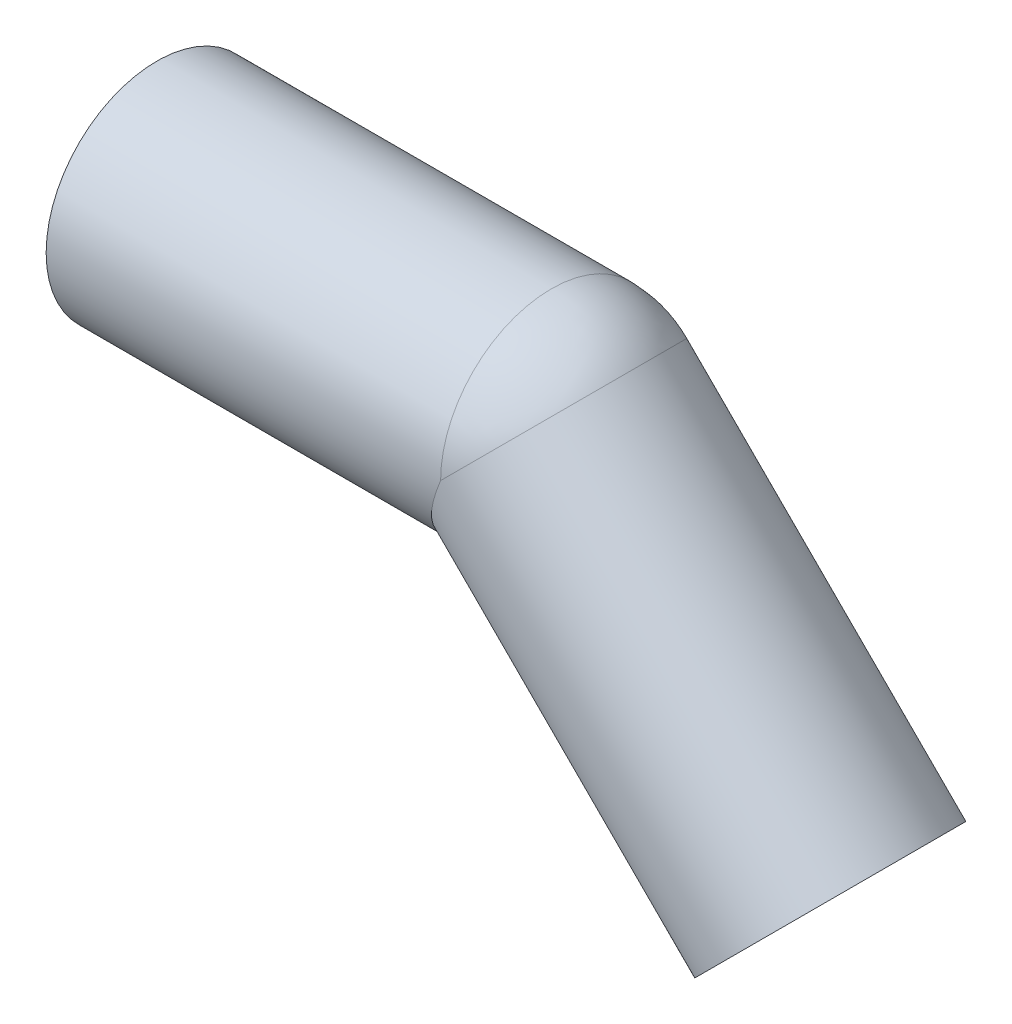
ISO-10303-21;
HEADER;
FILE_DESCRIPTION(('STEP AP214'),'2;1');
FILE_NAME('part.step','',(''),(''),'','','');
FILE_SCHEMA(('AUTOMOTIVE_DESIGN { 1 0 10303 214 1 1 1 1 }'));
ENDSEC;
DATA;
#1=APPLICATION_CONTEXT('core data for automotive mechanical design processes');
#2=APPLICATION_PROTOCOL_DEFINITION('international standard','automotive_design',2000,#1);
#3=PRODUCT_CONTEXT('',#1,'mechanical');
#4=PRODUCT('Part','Part','',(#3));
#5=PRODUCT_RELATED_PRODUCT_CATEGORY('part','',(#4));
#6=PRODUCT_DEFINITION_FORMATION('','',#4);
#7=PRODUCT_DEFINITION_CONTEXT('part definition',#1,'design');
#8=PRODUCT_DEFINITION('design','',#6,#7);
#9=PRODUCT_DEFINITION_SHAPE('','',#8);
#10=(LENGTH_UNIT() NAMED_UNIT(*) SI_UNIT(.MILLI.,.METRE.));
#11=(NAMED_UNIT(*) PLANE_ANGLE_UNIT() SI_UNIT($,.RADIAN.));
#12=(NAMED_UNIT(*) SI_UNIT($,.STERADIAN.) SOLID_ANGLE_UNIT());
#13=UNCERTAINTY_MEASURE_WITH_UNIT(LENGTH_MEASURE(1.E-05),#10,'distance_accuracy_value','');
#14=(GEOMETRIC_REPRESENTATION_CONTEXT(3) GLOBAL_UNCERTAINTY_ASSIGNED_CONTEXT((#13)) GLOBAL_UNIT_ASSIGNED_CONTEXT((#10,
#11,#12)) REPRESENTATION_CONTEXT('',''));
#15=CARTESIAN_POINT('',(0.,0.,0.));
#16=DIRECTION('',(0.,0.,1.));
#17=DIRECTION('',(1.,0.,0.));
#18=AXIS2_PLACEMENT_3D('',#15,#16,#17);
#19=CARTESIAN_POINT('',(97.3050865276333,-40.305086527633,0.));
#20=DIRECTION('',(-0.707106781186554,0.707106781186541,0.));
#21=DIRECTION('',(-0.707106781186541,-0.707106781186554,0.));
#22=AXIS2_PLACEMENT_3D('',#19,#20,#21);
#23=CYLINDRICAL_SURFACE('',#22,13.1000000000001);
#24=CARTESIAN_POINT('',(57.,0.,0.));
#25=DIRECTION('',(0.707106781186548,-0.707106781186547,0.));
#26=DIRECTION('',(0.,0.,-1.));
#27=AXIS2_PLACEMENT_3D('',#24,#25,#26);
#28=CIRCLE('',#27,13.1);
#29=CARTESIAN_POINT('',(66.2630988332956,9.26309883379197,0.));
#30=VERTEX_POINT('',#29);
#31=CARTESIAN_POINT('',(56.9999999999996,1.55045865047006E-13,13.1));
#32=VERTEX_POINT('',#31);
#33=EDGE_CURVE('E53',#30,#32,#28,.T.);
#34=ORIENTED_EDGE('',*,*,#33,.F.);
#35=CARTESIAN_POINT('',(57.,0.,0.));
#36=DIRECTION('',(0.707106781243387,-0.707106781129708,0.));
#37=DIRECTION('',(0.,0.,-1.));
#38=AXIS2_PLACEMENT_3D('',#35,#36,#37);
#39=CIRCLE('',#38,13.1);
#40=CARTESIAN_POINT('',(56.9999999999996,1.46267343106297E-13,-13.1));
#41=VERTEX_POINT('',#40);
#42=EDGE_CURVE('E46',#41,#30,#39,.T.);
#43=ORIENTED_EDGE('',*,*,#42,.F.);
#44=CARTESIAN_POINT('',(56.9999999999996,0.,0.));
#45=DIRECTION('',(-0.923879532511288,0.382683432365086,0.));
#46=DIRECTION('',(-0.382683432365086,-0.923879532511288,0.));
#47=AXIS2_PLACEMENT_3D('',#44,#45,#46);
#48=ELLIPSE('',#47,14.1793378238304,13.1);
#49=EDGE_CURVE('E55',#32,#41,#48,.F.);
#50=ORIENTED_EDGE('',*,*,#49,.F.);
#51=EDGE_LOOP('',(#34,#43,#50));
#52=FACE_BOUND('',#51,.T.);
#53=CARTESIAN_POINT('',(97.3050865276334,-40.3050865276331,0.));
#54=DIRECTION('',(-0.707106781186554,0.707106781186541,0.));
#55=DIRECTION('',(-0.707106781186541,-0.707106781186554,0.));
#56=AXIS2_PLACEMENT_3D('',#53,#54,#55);
#57=CIRCLE('',#56,13.1000000000001);
#58=CARTESIAN_POINT('',(88.0419876940897,-49.568185361177,0.));
#59=VERTEX_POINT('',#58);
#60=EDGE_CURVE('E18',#59,#59,#57,.T.);
#61=ORIENTED_EDGE('',*,*,#60,.F.);
#62=EDGE_LOOP('',(#61));
#63=FACE_BOUND('',#62,.T.);
#64=ADVANCED_FACE('F15',(#52,#63),#23,.F.);
#65=CARTESIAN_POINT('',(57.,0.,0.));
#66=DIRECTION('',(0.,0.,1.));
#67=DIRECTION('',(-1.,0.,0.));
#68=AXIS2_PLACEMENT_3D('',#65,#66,#67);
#69=SPHERICAL_SURFACE('',#68,13.1);
#70=CARTESIAN_POINT('',(57.,0.,0.));
#71=DIRECTION('',(-1.,0.,0.));
#72=DIRECTION('',(0.,1.,0.));
#73=AXIS2_PLACEMENT_3D('',#70,#71,#72);
#74=CIRCLE('',#73,13.1);
#75=EDGE_CURVE('E51',#41,#32,#74,.F.);
#76=ORIENTED_EDGE('',*,*,#75,.F.);
#77=ORIENTED_EDGE('',*,*,#42,.T.);
#78=ORIENTED_EDGE('',*,*,#33,.T.);
#79=EDGE_LOOP('',(#76,#77,#78));
#80=FACE_BOUND('',#79,.T.);
#81=ADVANCED_FACE('F58',(#80),#69,.F.);
#82=CARTESIAN_POINT('',(108.618795026619,-28.9913780286475,16.1920021083517));
#83=DIRECTION('',(0.707106781186547,-0.707106781186548,0.));
#84=DIRECTION('',(-0.707106781186548,-0.707106781186547,0.));
#85=AXIS2_PLACEMENT_3D('',#82,#83,#84);
#86=PLANE('',#85);
#87=ORIENTED_EDGE('',*,*,#60,.T.);
#88=EDGE_LOOP('',(#87));
#89=FACE_BOUND('',#88,.T.);
#90=CARTESIAN_POINT('',(97.3050865276334,-40.3050865276331,0.));
#91=DIRECTION('',(-0.707106781186553,0.707106781186542,0.));
#92=DIRECTION('',(-0.707106781186542,-0.707106781186553,0.));
#93=AXIS2_PLACEMENT_3D('',#90,#91,#92);
#94=CIRCLE('',#93,16.);
#95=CARTESIAN_POINT('',(85.9913780286488,-51.618795026618,0.));
#96=VERTEX_POINT('',#95);
#97=EDGE_CURVE('E71',#96,#96,#94,.T.);
#98=ORIENTED_EDGE('',*,*,#97,.F.);
#99=EDGE_LOOP('',(#98));
#100=FACE_BOUND('',#99,.T.);
#101=ADVANCED_FACE('F80',(#89,#100),#86,.T.);
#102=CARTESIAN_POINT('',(57.,0.,0.));
#103=DIRECTION('',(-1.,0.,0.));
#104=DIRECTION('',(0.,0.,1.));
#105=AXIS2_PLACEMENT_3D('',#102,#103,#104);
#106=CYLINDRICAL_SURFACE('',#105,13.1);
#107=CARTESIAN_POINT('',(0.,0.,0.));
#108=DIRECTION('',(-1.,0.,0.));
#109=DIRECTION('',(0.,0.,1.));
#110=AXIS2_PLACEMENT_3D('',#107,#108,#109);
#111=CIRCLE('',#110,13.1);
#112=CARTESIAN_POINT('',(0.,0.,13.1));
#113=VERTEX_POINT('',#112);
#114=EDGE_CURVE('E68',#113,#113,#111,.F.);
#115=ORIENTED_EDGE('',*,*,#114,.F.);
#116=EDGE_LOOP('',(#115));
#117=FACE_BOUND('',#116,.T.);
#118=ORIENTED_EDGE('',*,*,#49,.T.);
#119=ORIENTED_EDGE('',*,*,#75,.T.);
#120=EDGE_LOOP('',(#118,#119));
#121=FACE_BOUND('',#120,.T.);
#122=ADVANCED_FACE('F83',(#117,#121),#106,.F.);
#123=CARTESIAN_POINT('',(57.,0.,0.));
#124=DIRECTION('',(0.,0.,1.));
#125=DIRECTION('',(1.,0.,0.));
#126=AXIS2_PLACEMENT_3D('',#123,#124,#125);
#127=SPHERICAL_SURFACE('',#126,16.);
#128=CARTESIAN_POINT('',(57.,0.,0.));
#129=DIRECTION('',(-1.,0.,0.));
#130=DIRECTION('',(0.,1.,0.));
#131=AXIS2_PLACEMENT_3D('',#128,#129,#130);
#132=CIRCLE('',#131,16.);
#133=CARTESIAN_POINT('',(56.9999999999997,0.,16.));
#134=VERTEX_POINT('',#133);
#135=CARTESIAN_POINT('',(56.9999999999997,0.,-16.0000000000001));
#136=VERTEX_POINT('',#135);
#137=EDGE_CURVE('E67',#134,#136,#132,.T.);
#138=ORIENTED_EDGE('',*,*,#137,.F.);
#139=CARTESIAN_POINT('',(57.,0.,0.));
#140=DIRECTION('',(-0.707106781123838,0.707106781249257,0.));
#141=DIRECTION('',(0.,0.,1.));
#142=AXIS2_PLACEMENT_3D('',#139,#140,#141);
#143=CIRCLE('',#142,16.);
#144=CARTESIAN_POINT('',(68.3137084994864,11.3137084984831,0.));
#145=VERTEX_POINT('',#144);
#146=EDGE_CURVE('E73',#134,#145,#143,.T.);
#147=ORIENTED_EDGE('',*,*,#146,.T.);
#148=CARTESIAN_POINT('',(56.9999999999999,-1.66533453693773E-13,0.));
#149=DIRECTION('',(-0.707106781186553,0.707106781186542,0.));
#150=DIRECTION('',(0.707106781186542,0.707106781186553,0.));
#151=AXIS2_PLACEMENT_3D('',#148,#149,#150);
#152=CIRCLE('',#151,16.0000000000002);
#153=EDGE_CURVE('E33',#136,#145,#152,.F.);
#154=ORIENTED_EDGE('',*,*,#153,.F.);
#155=EDGE_LOOP('',(#138,#147,#154));
#156=FACE_BOUND('',#155,.T.);
#157=ADVANCED_FACE('F87',(#156),#127,.T.);
#158=CARTESIAN_POINT('',(56.9999999999999,-1.64798730217797E-13,0.));
#159=DIRECTION('',(-0.707106781186553,0.707106781186542,0.));
#160=DIRECTION('',(-0.707106781186542,-0.707106781186553,0.));
#161=AXIS2_PLACEMENT_3D('',#158,#159,#160);
#162=CYLINDRICAL_SURFACE('',#161,16.);
#163=ORIENTED_EDGE('',*,*,#97,.T.);
#164=EDGE_LOOP('',(#163));
#165=FACE_BOUND('',#164,.T.);
#166=CARTESIAN_POINT('',(56.9999999999997,0.,0.));
#167=DIRECTION('',(-0.923879532511288,0.382683432365086,0.));
#168=DIRECTION('',(0.382683432365086,0.923879532511288,0.));
#169=AXIS2_PLACEMENT_3D('',#166,#167,#168);
#170=ELLIPSE('',#169,17.3182752046783,16.);
#171=EDGE_CURVE('E24',#136,#134,#170,.T.);
#172=ORIENTED_EDGE('',*,*,#171,.F.);
#173=ORIENTED_EDGE('',*,*,#153,.T.);
#174=ORIENTED_EDGE('',*,*,#146,.F.);
#175=EDGE_LOOP('',(#172,#173,#174));
#176=FACE_BOUND('',#175,.T.);
#177=ADVANCED_FACE('F91',(#165,#176),#162,.T.);
#178=CARTESIAN_POINT('',(0.,-16.,16.1920021084034));
#179=DIRECTION('',(-1.,0.,0.));
#180=DIRECTION('',(0.,1.,0.));
#181=AXIS2_PLACEMENT_3D('',#178,#179,#180);
#182=PLANE('',#181);
#183=ORIENTED_EDGE('',*,*,#114,.T.);
#184=EDGE_LOOP('',(#183));
#185=FACE_BOUND('',#184,.T.);
#186=CARTESIAN_POINT('',(0.,0.,0.));
#187=DIRECTION('',(-1.,0.,0.));
#188=DIRECTION('',(0.,0.,1.));
#189=AXIS2_PLACEMENT_3D('',#186,#187,#188);
#190=CIRCLE('',#189,16.);
#191=CARTESIAN_POINT('',(0.,0.,16.));
#192=VERTEX_POINT('',#191);
#193=EDGE_CURVE('E9',#192,#192,#190,.F.);
#194=ORIENTED_EDGE('',*,*,#193,.F.);
#195=EDGE_LOOP('',(#194));
#196=FACE_BOUND('',#195,.T.);
#197=ADVANCED_FACE('F105',(#185,#196),#182,.T.);
#198=CARTESIAN_POINT('',(0.,0.,0.));
#199=DIRECTION('',(-1.,0.,0.));
#200=DIRECTION('',(0.,0.,1.));
#201=AXIS2_PLACEMENT_3D('',#198,#199,#200);
#202=CYLINDRICAL_SURFACE('',#201,16.);
#203=ORIENTED_EDGE('',*,*,#171,.T.);
#204=ORIENTED_EDGE('',*,*,#137,.T.);
#205=EDGE_LOOP('',(#203,#204));
#206=FACE_BOUND('',#205,.T.);
#207=ORIENTED_EDGE('',*,*,#193,.T.);
#208=EDGE_LOOP('',(#207));
#209=FACE_BOUND('',#208,.T.);
#210=ADVANCED_FACE('F102',(#206,#209),#202,.T.);
#211=CLOSED_SHELL('',(#64,#81,#101,#122,#157,#177,#197,#210));
#212=MANIFOLD_SOLID_BREP('B1',#211);
#213=ADVANCED_BREP_SHAPE_REPRESENTATION('',(#18,#212),#14);
#214=SHAPE_DEFINITION_REPRESENTATION(#9,#213);
ENDSEC;
END-ISO-10303-21;
